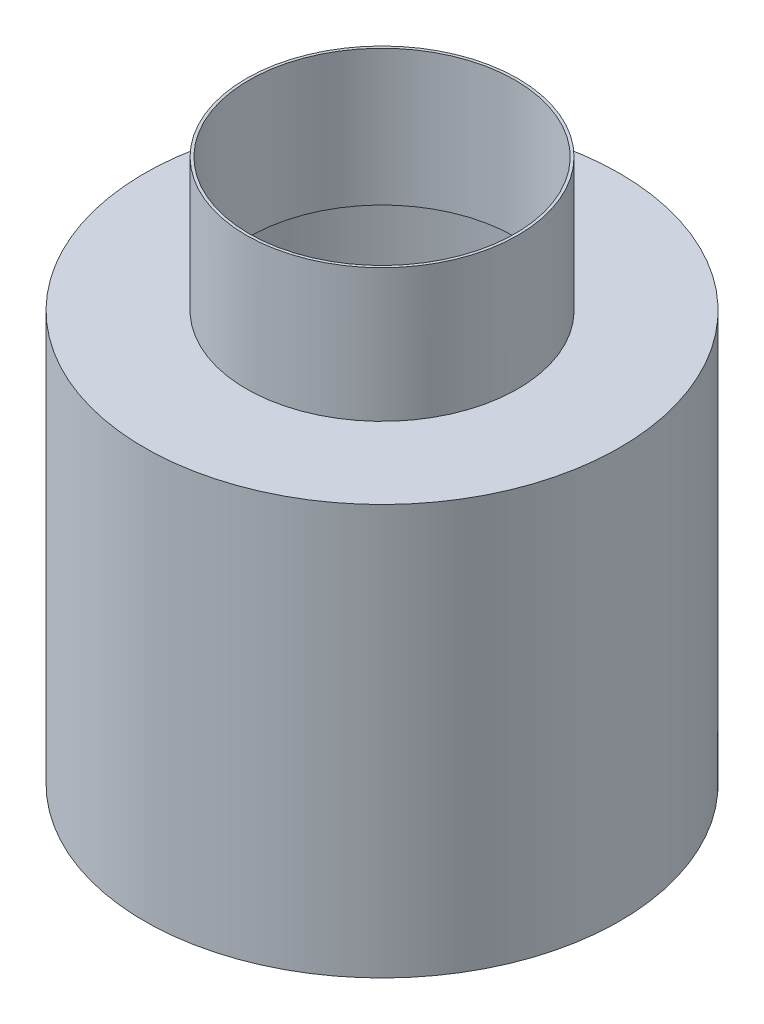
ISO-10303-21;
HEADER;
FILE_DESCRIPTION(('STEP AP214'),'2;1');
FILE_NAME('part.step','',(''),(''),'','','');
FILE_SCHEMA(('AUTOMOTIVE_DESIGN { 1 0 10303 214 1 1 1 1 }'));
ENDSEC;
DATA;
#1=APPLICATION_CONTEXT('core data for automotive mechanical design processes');
#2=APPLICATION_PROTOCOL_DEFINITION('international standard','automotive_design',2000,#1);
#3=PRODUCT_CONTEXT('',#1,'mechanical');
#4=PRODUCT('Part','Part','',(#3));
#5=PRODUCT_RELATED_PRODUCT_CATEGORY('part','',(#4));
#6=PRODUCT_DEFINITION_FORMATION('','',#4);
#7=PRODUCT_DEFINITION_CONTEXT('part definition',#1,'design');
#8=PRODUCT_DEFINITION('design','',#6,#7);
#9=PRODUCT_DEFINITION_SHAPE('','',#8);
#10=(LENGTH_UNIT() NAMED_UNIT(*) SI_UNIT(.MILLI.,.METRE.));
#11=(NAMED_UNIT(*) PLANE_ANGLE_UNIT() SI_UNIT($,.RADIAN.));
#12=(NAMED_UNIT(*) SI_UNIT($,.STERADIAN.) SOLID_ANGLE_UNIT());
#13=UNCERTAINTY_MEASURE_WITH_UNIT(LENGTH_MEASURE(1.E-05),#10,'distance_accuracy_value','');
#14=(GEOMETRIC_REPRESENTATION_CONTEXT(3) GLOBAL_UNCERTAINTY_ASSIGNED_CONTEXT((#13)) GLOBAL_UNIT_ASSIGNED_CONTEXT((#10,
#11,#12)) REPRESENTATION_CONTEXT('',''));
#15=CARTESIAN_POINT('',(0.,0.,0.));
#16=DIRECTION('',(0.,0.,1.));
#17=DIRECTION('',(1.,0.,0.));
#18=AXIS2_PLACEMENT_3D('',#15,#16,#17);
#19=CARTESIAN_POINT('',(0.,-302.,0.));
#20=DIRECTION('',(0.,1.,0.));
#21=DIRECTION('',(0.,0.,1.));
#22=AXIS2_PLACEMENT_3D('',#19,#20,#21);
#23=CYLINDRICAL_SURFACE('',#22,173.);
#24=CARTESIAN_POINT('',(0.,-2.,0.));
#25=DIRECTION('',(0.,-1.,0.));
#26=DIRECTION('',(0.,0.,-1.));
#27=AXIS2_PLACEMENT_3D('',#24,#25,#26);
#28=CIRCLE('',#27,173.);
#29=CARTESIAN_POINT('',(0.,-2.,-173.));
#30=VERTEX_POINT('',#29);
#31=EDGE_CURVE('E10',#30,#30,#28,.F.);
#32=ORIENTED_EDGE('',*,*,#31,.T.);
#33=EDGE_LOOP('',(#32));
#34=FACE_BOUND('',#33,.T.);
#35=CARTESIAN_POINT('',(0.,-300.,0.));
#36=DIRECTION('',(0.,-1.,0.));
#37=DIRECTION('',(0.,0.,-1.));
#38=AXIS2_PLACEMENT_3D('',#35,#36,#37);
#39=CIRCLE('',#38,173.);
#40=CARTESIAN_POINT('',(0.,-300.,-173.));
#41=VERTEX_POINT('',#40);
#42=EDGE_CURVE('E34',#41,#41,#39,.T.);
#43=ORIENTED_EDGE('',*,*,#42,.T.);
#44=EDGE_LOOP('',(#43));
#45=FACE_BOUND('',#44,.T.);
#46=ADVANCED_FACE('F30',(#34,#45),#23,.F.);
#47=CARTESIAN_POINT('',(0.,-2.,0.));
#48=DIRECTION('',(0.,-1.,0.));
#49=DIRECTION('',(0.,0.,-1.));
#50=AXIS2_PLACEMENT_3D('',#47,#48,#49);
#51=PLANE('',#50);
#52=CARTESIAN_POINT('',(0.,-2.,0.));
#53=DIRECTION('',(0.,-1.,0.));
#54=DIRECTION('',(0.,0.,-1.));
#55=AXIS2_PLACEMENT_3D('',#52,#53,#54);
#56=CIRCLE('',#55,98.);
#57=CARTESIAN_POINT('',(0.,-2.,-98.));
#58=VERTEX_POINT('',#57);
#59=EDGE_CURVE('E53',#58,#58,#56,.T.);
#60=ORIENTED_EDGE('',*,*,#59,.F.);
#61=EDGE_LOOP('',(#60));
#62=FACE_BOUND('',#61,.T.);
#63=ORIENTED_EDGE('',*,*,#31,.F.);
#64=EDGE_LOOP('',(#63));
#65=FACE_BOUND('',#64,.T.);
#66=ADVANCED_FACE('F75',(#62,#65),#51,.T.);
#67=CARTESIAN_POINT('',(0.,98.,0.));
#68=DIRECTION('',(0.,-1.,0.));
#69=DIRECTION('',(0.,0.,-1.));
#70=AXIS2_PLACEMENT_3D('',#67,#68,#69);
#71=CYLINDRICAL_SURFACE('',#70,100.);
#72=CARTESIAN_POINT('',(0.,98.,0.));
#73=DIRECTION('',(0.,1.,0.));
#74=DIRECTION('',(0.,0.,1.));
#75=AXIS2_PLACEMENT_3D('',#72,#73,#74);
#76=CIRCLE('',#75,100.);
#77=CARTESIAN_POINT('',(0.,98.,100.));
#78=VERTEX_POINT('',#77);
#79=EDGE_CURVE('E38',#78,#78,#76,.T.);
#80=ORIENTED_EDGE('',*,*,#79,.F.);
#81=EDGE_LOOP('',(#80));
#82=FACE_BOUND('',#81,.T.);
#83=CARTESIAN_POINT('',(0.,0.,0.));
#84=DIRECTION('',(0.,-1.,0.));
#85=DIRECTION('',(0.,0.,-1.));
#86=AXIS2_PLACEMENT_3D('',#83,#84,#85);
#87=CIRCLE('',#86,100.);
#88=CARTESIAN_POINT('',(0.,0.,-100.));
#89=VERTEX_POINT('',#88);
#90=EDGE_CURVE('E47',#89,#89,#87,.T.);
#91=ORIENTED_EDGE('',*,*,#90,.F.);
#92=EDGE_LOOP('',(#91));
#93=FACE_BOUND('',#92,.T.);
#94=ADVANCED_FACE('F32',(#82,#93),#71,.T.);
#95=CARTESIAN_POINT('',(0.,98.,0.));
#96=DIRECTION('',(0.,1.,0.));
#97=DIRECTION('',(0.,0.,1.));
#98=AXIS2_PLACEMENT_3D('',#95,#96,#97);
#99=PLANE('',#98);
#100=CARTESIAN_POINT('',(0.,98.,0.));
#101=DIRECTION('',(0.,1.,0.));
#102=DIRECTION('',(0.,0.,1.));
#103=AXIS2_PLACEMENT_3D('',#100,#101,#102);
#104=CIRCLE('',#103,98.);
#105=CARTESIAN_POINT('',(0.,98.,98.));
#106=VERTEX_POINT('',#105);
#107=EDGE_CURVE('E42',#106,#106,#104,.T.);
#108=ORIENTED_EDGE('',*,*,#107,.F.);
#109=EDGE_LOOP('',(#108));
#110=FACE_BOUND('',#109,.T.);
#111=ORIENTED_EDGE('',*,*,#79,.T.);
#112=EDGE_LOOP('',(#111));
#113=FACE_BOUND('',#112,.T.);
#114=ADVANCED_FACE('F91',(#110,#113),#99,.T.);
#115=CARTESIAN_POINT('',(0.,-299.,0.));
#116=DIRECTION('',(0.,1.,0.));
#117=DIRECTION('',(0.,0.,1.));
#118=AXIS2_PLACEMENT_3D('',#115,#116,#117);
#119=CYLINDRICAL_SURFACE('',#118,98.);
#120=ORIENTED_EDGE('',*,*,#107,.T.);
#121=EDGE_LOOP('',(#120));
#122=FACE_BOUND('',#121,.T.);
#123=ORIENTED_EDGE('',*,*,#59,.T.);
#124=EDGE_LOOP('',(#123));
#125=FACE_BOUND('',#124,.T.);
#126=ADVANCED_FACE('F85',(#122,#125),#119,.F.);
#127=CARTESIAN_POINT('',(0.,0.,0.));
#128=DIRECTION('',(0.,-1.,0.));
#129=DIRECTION('',(0.,0.,-1.));
#130=AXIS2_PLACEMENT_3D('',#127,#128,#129);
#131=PLANE('',#130);
#132=CARTESIAN_POINT('',(0.,0.,0.));
#133=DIRECTION('',(0.,-1.,0.));
#134=DIRECTION('',(0.,0.,-1.));
#135=AXIS2_PLACEMENT_3D('',#132,#133,#134);
#136=CIRCLE('',#135,175.);
#137=CARTESIAN_POINT('',(0.,0.,-175.));
#138=VERTEX_POINT('',#137);
#139=EDGE_CURVE('E50',#138,#138,#136,.T.);
#140=ORIENTED_EDGE('',*,*,#139,.F.);
#141=EDGE_LOOP('',(#140));
#142=FACE_BOUND('',#141,.T.);
#143=ORIENTED_EDGE('',*,*,#90,.T.);
#144=EDGE_LOOP('',(#143));
#145=FACE_BOUND('',#144,.T.);
#146=ADVANCED_FACE('F82',(#142,#145),#131,.F.);
#147=CARTESIAN_POINT('',(0.,-2.,0.));
#148=DIRECTION('',(0.,1.,0.));
#149=DIRECTION('',(0.,0.,1.));
#150=AXIS2_PLACEMENT_3D('',#147,#148,#149);
#151=CYLINDRICAL_SURFACE('',#150,175.);
#152=CARTESIAN_POINT('',(0.,-302.,0.));
#153=DIRECTION('',(0.,-1.,0.));
#154=DIRECTION('',(0.,0.,-1.));
#155=AXIS2_PLACEMENT_3D('',#152,#153,#154);
#156=CIRCLE('',#155,175.);
#157=CARTESIAN_POINT('',(0.,-302.,-175.));
#158=VERTEX_POINT('',#157);
#159=EDGE_CURVE('E56',#158,#158,#156,.T.);
#160=ORIENTED_EDGE('',*,*,#159,.F.);
#161=EDGE_LOOP('',(#160));
#162=FACE_BOUND('',#161,.T.);
#163=ORIENTED_EDGE('',*,*,#139,.T.);
#164=EDGE_LOOP('',(#163));
#165=FACE_BOUND('',#164,.T.);
#166=ADVANCED_FACE('F71',(#162,#165),#151,.T.);
#167=CARTESIAN_POINT('',(0.,-302.,0.));
#168=DIRECTION('',(0.,-1.,0.));
#169=DIRECTION('',(0.,0.,-1.));
#170=AXIS2_PLACEMENT_3D('',#167,#168,#169);
#171=PLANE('',#170);
#172=ORIENTED_EDGE('',*,*,#159,.T.);
#173=EDGE_LOOP('',(#172));
#174=FACE_BOUND('',#173,.T.);
#175=ADVANCED_FACE('F66',(#174),#171,.T.);
#176=CARTESIAN_POINT('',(0.,-300.,0.));
#177=DIRECTION('',(0.,-1.,0.));
#178=DIRECTION('',(0.,0.,-1.));
#179=AXIS2_PLACEMENT_3D('',#176,#177,#178);
#180=PLANE('',#179);
#181=ORIENTED_EDGE('',*,*,#42,.F.);
#182=EDGE_LOOP('',(#181));
#183=FACE_BOUND('',#182,.T.);
#184=ADVANCED_FACE('F64',(#183),#180,.F.);
#185=CLOSED_SHELL('',(#46,#66,#94,#114,#126,#146,#166,#175,#184));
#186=MANIFOLD_SOLID_BREP('B2',#185);
#187=ADVANCED_BREP_SHAPE_REPRESENTATION('',(#18,#186),#14);
#188=SHAPE_DEFINITION_REPRESENTATION(#9,#187);
ENDSEC;
END-ISO-10303-21;
